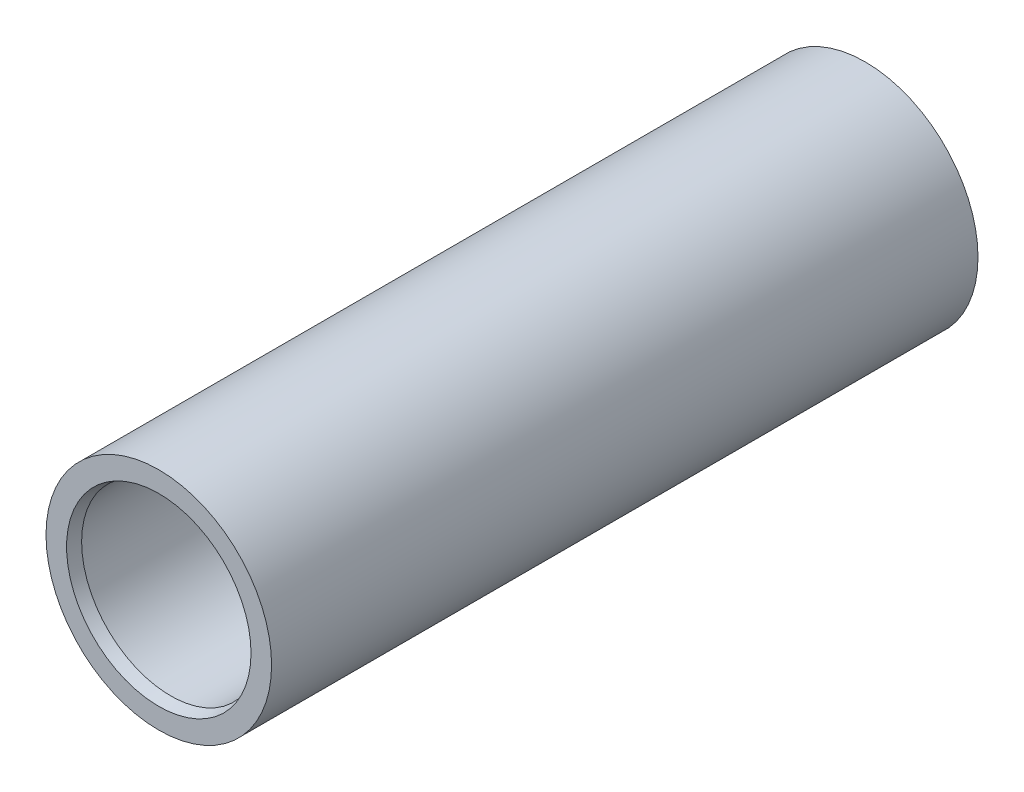
ISO-10303-21;
HEADER;
FILE_DESCRIPTION(('STEP AP214'),'2;1');
FILE_NAME('part.step','',(''),(''),'','','');
FILE_SCHEMA(('AUTOMOTIVE_DESIGN { 1 0 10303 214 1 1 1 1 }'));
ENDSEC;
DATA;
#1=APPLICATION_CONTEXT('core data for automotive mechanical design processes');
#2=APPLICATION_PROTOCOL_DEFINITION('international standard','automotive_design',2000,#1);
#3=PRODUCT_CONTEXT('',#1,'mechanical');
#4=PRODUCT('Part','Part','',(#3));
#5=PRODUCT_RELATED_PRODUCT_CATEGORY('part','',(#4));
#6=PRODUCT_DEFINITION_FORMATION('','',#4);
#7=PRODUCT_DEFINITION_CONTEXT('part definition',#1,'design');
#8=PRODUCT_DEFINITION('design','',#6,#7);
#9=PRODUCT_DEFINITION_SHAPE('','',#8);
#10=(LENGTH_UNIT() NAMED_UNIT(*) SI_UNIT(.MILLI.,.METRE.));
#11=(NAMED_UNIT(*) PLANE_ANGLE_UNIT() SI_UNIT($,.RADIAN.));
#12=(NAMED_UNIT(*) SI_UNIT($,.STERADIAN.) SOLID_ANGLE_UNIT());
#13=UNCERTAINTY_MEASURE_WITH_UNIT(LENGTH_MEASURE(1.E-05),#10,'distance_accuracy_value','');
#14=(GEOMETRIC_REPRESENTATION_CONTEXT(3) GLOBAL_UNCERTAINTY_ASSIGNED_CONTEXT((#13)) GLOBAL_UNIT_ASSIGNED_CONTEXT((#10,
#11,#12)) REPRESENTATION_CONTEXT('',''));
#15=CARTESIAN_POINT('',(0.,0.,0.));
#16=DIRECTION('',(0.,0.,1.));
#17=DIRECTION('',(1.,0.,0.));
#18=AXIS2_PLACEMENT_3D('',#15,#16,#17);
#19=CARTESIAN_POINT('',(0.,0.,238.));
#20=DIRECTION('',(0.,0.,1.));
#21=DIRECTION('',(1.,0.,0.));
#22=AXIS2_PLACEMENT_3D('',#19,#20,#21);
#23=PLANE('',#22);
#24=CARTESIAN_POINT('',(0.,0.,238.));
#25=DIRECTION('',(0.,0.,1.));
#26=DIRECTION('',(1.,0.,0.));
#27=AXIS2_PLACEMENT_3D('',#24,#25,#26);
#28=CIRCLE('',#27,31.0717967697244);
#29=CARTESIAN_POINT('',(31.0717967697244,0.,238.));
#30=VERTEX_POINT('',#29);
#31=EDGE_CURVE('E10',#30,#30,#28,.F.);
#32=ORIENTED_EDGE('',*,*,#31,.T.);
#33=EDGE_LOOP('',(#32));
#34=FACE_BOUND('',#33,.T.);
#35=CARTESIAN_POINT('',(0.,0.,238.));
#36=DIRECTION('',(0.,0.,1.));
#37=DIRECTION('',(1.,0.,0.));
#38=AXIS2_PLACEMENT_3D('',#35,#36,#37);
#39=CIRCLE('',#38,38.);
#40=CARTESIAN_POINT('',(38.,0.,238.));
#41=VERTEX_POINT('',#40);
#42=EDGE_CURVE('E59',#41,#41,#39,.T.);
#43=ORIENTED_EDGE('',*,*,#42,.T.);
#44=EDGE_LOOP('',(#43));
#45=FACE_BOUND('',#44,.T.);
#46=ADVANCED_FACE('F38',(#34,#45),#23,.T.);
#47=CARTESIAN_POINT('',(0.,0.,0.));
#48=DIRECTION('',(0.,0.,1.));
#49=DIRECTION('',(1.,0.,0.));
#50=AXIS2_PLACEMENT_3D('',#47,#48,#49);
#51=PLANE('',#50);
#52=CARTESIAN_POINT('',(0.,0.,0.));
#53=DIRECTION('',(0.,0.,1.));
#54=DIRECTION('',(1.,0.,0.));
#55=AXIS2_PLACEMENT_3D('',#52,#53,#54);
#56=CIRCLE('',#55,31.0717967697245);
#57=CARTESIAN_POINT('',(31.0717967697245,0.,0.));
#58=VERTEX_POINT('',#57);
#59=EDGE_CURVE('E54',#58,#58,#56,.T.);
#60=ORIENTED_EDGE('',*,*,#59,.T.);
#61=EDGE_LOOP('',(#60));
#62=FACE_BOUND('',#61,.T.);
#63=CARTESIAN_POINT('',(0.,0.,0.));
#64=DIRECTION('',(0.,0.,1.));
#65=DIRECTION('',(1.,0.,0.));
#66=AXIS2_PLACEMENT_3D('',#63,#64,#65);
#67=CIRCLE('',#66,38.);
#68=CARTESIAN_POINT('',(38.,0.,0.));
#69=VERTEX_POINT('',#68);
#70=EDGE_CURVE('E60',#69,#69,#67,.T.);
#71=ORIENTED_EDGE('',*,*,#70,.F.);
#72=EDGE_LOOP('',(#71));
#73=FACE_BOUND('',#72,.T.);
#74=ADVANCED_FACE('F71',(#62,#73),#51,.F.);
#75=CARTESIAN_POINT('',(0.,0.,238.));
#76=DIRECTION('',(0.,0.,-1.));
#77=DIRECTION('',(-1.,0.,0.));
#78=AXIS2_PLACEMENT_3D('',#75,#76,#77);
#79=CYLINDRICAL_SURFACE('',#78,38.);
#80=ORIENTED_EDGE('',*,*,#42,.F.);
#81=EDGE_LOOP('',(#80));
#82=FACE_BOUND('',#81,.T.);
#83=ORIENTED_EDGE('',*,*,#70,.T.);
#84=EDGE_LOOP('',(#83));
#85=FACE_BOUND('',#84,.T.);
#86=ADVANCED_FACE('F67',(#82,#85),#79,.T.);
#87=CARTESIAN_POINT('',(0.,0.,238.));
#88=DIRECTION('',(0.,0.,-1.));
#89=DIRECTION('',(-1.,0.,0.));
#90=AXIS2_PLACEMENT_3D('',#87,#88,#89);
#91=CYLINDRICAL_SURFACE('',#90,30.);
#92=CARTESIAN_POINT('',(0.,0.,234.));
#93=DIRECTION('',(0.,0.,1.));
#94=DIRECTION('',(1.,0.,0.));
#95=AXIS2_PLACEMENT_3D('',#92,#93,#94);
#96=CIRCLE('',#95,30.);
#97=CARTESIAN_POINT('',(30.,0.,234.));
#98=VERTEX_POINT('',#97);
#99=EDGE_CURVE('E46',#98,#98,#96,.T.);
#100=ORIENTED_EDGE('',*,*,#99,.T.);
#101=EDGE_LOOP('',(#100));
#102=FACE_BOUND('',#101,.T.);
#103=CARTESIAN_POINT('',(0.,0.,4.));
#104=DIRECTION('',(0.,0.,1.));
#105=DIRECTION('',(1.,0.,0.));
#106=AXIS2_PLACEMENT_3D('',#103,#104,#105);
#107=CIRCLE('',#106,30.);
#108=CARTESIAN_POINT('',(30.,0.,4.));
#109=VERTEX_POINT('',#108);
#110=EDGE_CURVE('E50',#109,#109,#107,.F.);
#111=ORIENTED_EDGE('',*,*,#110,.T.);
#112=EDGE_LOOP('',(#111));
#113=FACE_BOUND('',#112,.T.);
#114=ADVANCED_FACE('F70',(#102,#113),#91,.F.);
#115=CARTESIAN_POINT('',(0.,0.,0.));
#116=DIRECTION('',(0.,0.,-1.));
#117=DIRECTION('',(-1.,0.,0.));
#118=AXIS2_PLACEMENT_3D('',#115,#116,#117);
#119=CONICAL_SURFACE('',#118,31.0717967697245,0.261799387799145);
#120=ORIENTED_EDGE('',*,*,#110,.F.);
#121=EDGE_LOOP('',(#120));
#122=FACE_BOUND('',#121,.T.);
#123=ORIENTED_EDGE('',*,*,#59,.F.);
#124=EDGE_LOOP('',(#123));
#125=FACE_BOUND('',#124,.T.);
#126=ADVANCED_FACE('F84',(#122,#125),#119,.F.);
#127=CARTESIAN_POINT('',(0.,0.,234.));
#128=DIRECTION('',(0.,0.,1.));
#129=DIRECTION('',(1.,0.,0.));
#130=AXIS2_PLACEMENT_3D('',#127,#128,#129);
#131=CONICAL_SURFACE('',#130,30.,0.261799387799145);
#132=ORIENTED_EDGE('',*,*,#31,.F.);
#133=EDGE_LOOP('',(#132));
#134=FACE_BOUND('',#133,.T.);
#135=ORIENTED_EDGE('',*,*,#99,.F.);
#136=EDGE_LOOP('',(#135));
#137=FACE_BOUND('',#136,.T.);
#138=ADVANCED_FACE('F41',(#134,#137),#131,.F.);
#139=CLOSED_SHELL('',(#46,#74,#86,#114,#126,#138));
#140=MANIFOLD_SOLID_BREP('B2',#139);
#141=ADVANCED_BREP_SHAPE_REPRESENTATION('',(#18,#140),#14);
#142=SHAPE_DEFINITION_REPRESENTATION(#9,#141);
ENDSEC;
END-ISO-10303-21;
